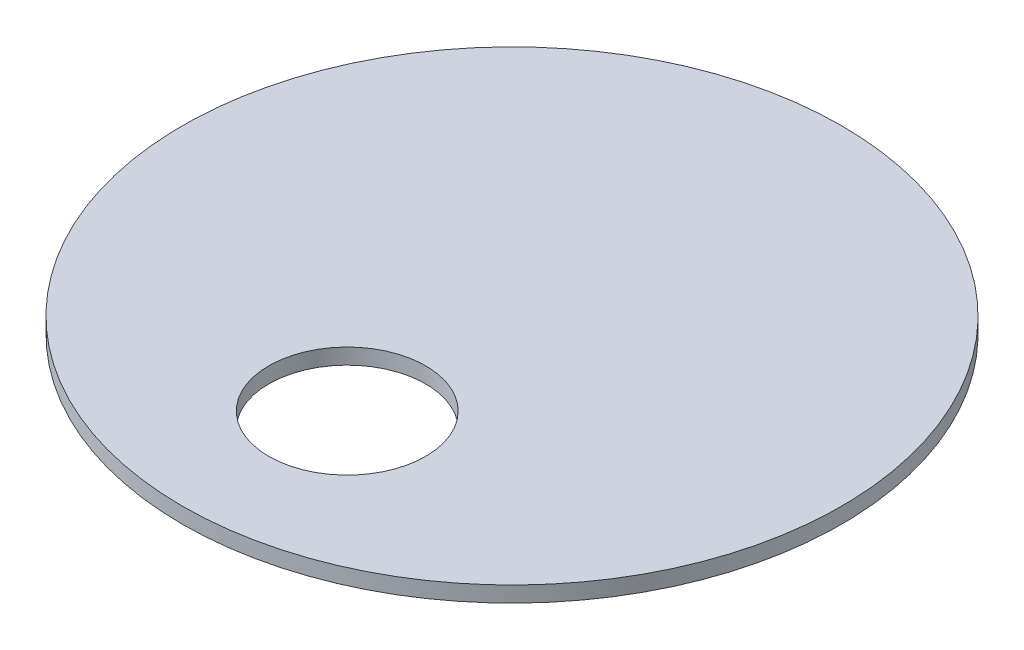
ISO-10303-21;
HEADER;
FILE_DESCRIPTION(('STEP AP214'),'2;1');
FILE_NAME('part.step','',(''),(''),'','','');
FILE_SCHEMA(('AUTOMOTIVE_DESIGN { 1 0 10303 214 1 1 1 1 }'));
ENDSEC;
DATA;
#1=APPLICATION_CONTEXT('core data for automotive mechanical design processes');
#2=APPLICATION_PROTOCOL_DEFINITION('international standard','automotive_design',2000,#1);
#3=PRODUCT_CONTEXT('',#1,'mechanical');
#4=PRODUCT('Part','Part','',(#3));
#5=PRODUCT_RELATED_PRODUCT_CATEGORY('part','',(#4));
#6=PRODUCT_DEFINITION_FORMATION('','',#4);
#7=PRODUCT_DEFINITION_CONTEXT('part definition',#1,'design');
#8=PRODUCT_DEFINITION('design','',#6,#7);
#9=PRODUCT_DEFINITION_SHAPE('','',#8);
#10=(LENGTH_UNIT() NAMED_UNIT(*) SI_UNIT(.MILLI.,.METRE.));
#11=(NAMED_UNIT(*) PLANE_ANGLE_UNIT() SI_UNIT($,.RADIAN.));
#12=(NAMED_UNIT(*) SI_UNIT($,.STERADIAN.) SOLID_ANGLE_UNIT());
#13=UNCERTAINTY_MEASURE_WITH_UNIT(LENGTH_MEASURE(1.E-05),#10,'distance_accuracy_value','');
#14=(GEOMETRIC_REPRESENTATION_CONTEXT(3) GLOBAL_UNCERTAINTY_ASSIGNED_CONTEXT((#13)) GLOBAL_UNIT_ASSIGNED_CONTEXT((#10,
#11,#12)) REPRESENTATION_CONTEXT('',''));
#15=CARTESIAN_POINT('',(0.,0.,0.));
#16=DIRECTION('',(0.,0.,1.));
#17=DIRECTION('',(1.,0.,0.));
#18=AXIS2_PLACEMENT_3D('',#15,#16,#17);
#19=CARTESIAN_POINT('',(0.,5.,0.));
#20=DIRECTION('',(0.,1.,0.));
#21=DIRECTION('',(0.,0.,1.));
#22=AXIS2_PLACEMENT_3D('',#19,#20,#21);
#23=PLANE('',#22);
#24=CARTESIAN_POINT('',(0.,5.,0.));
#25=DIRECTION('',(0.,1.,0.));
#26=DIRECTION('',(0.,0.,1.));
#27=AXIS2_PLACEMENT_3D('',#24,#25,#26);
#28=CIRCLE('',#27,105.);
#29=CARTESIAN_POINT('',(0.,5.,105.));
#30=VERTEX_POINT('',#29);
#31=EDGE_CURVE('E10',#30,#30,#28,.T.);
#32=ORIENTED_EDGE('',*,*,#31,.T.);
#33=EDGE_LOOP('',(#32));
#34=FACE_BOUND('',#33,.T.);
#35=CARTESIAN_POINT('',(0.,5.,52.5));
#36=DIRECTION('',(0.,1.,0.));
#37=DIRECTION('',(0.,0.,1.));
#38=AXIS2_PLACEMENT_3D('',#35,#36,#37);
#39=CIRCLE('',#38,25.);
#40=CARTESIAN_POINT('',(0.,5.,77.5));
#41=VERTEX_POINT('',#40);
#42=EDGE_CURVE('E42',#41,#41,#39,.T.);
#43=ORIENTED_EDGE('',*,*,#42,.F.);
#44=EDGE_LOOP('',(#43));
#45=FACE_BOUND('',#44,.T.);
#46=ADVANCED_FACE('F31',(#34,#45),#23,.T.);
#47=CARTESIAN_POINT('',(0.,0.,0.));
#48=DIRECTION('',(0.,1.,0.));
#49=DIRECTION('',(0.,0.,1.));
#50=AXIS2_PLACEMENT_3D('',#47,#48,#49);
#51=PLANE('',#50);
#52=CARTESIAN_POINT('',(0.,0.,0.));
#53=DIRECTION('',(0.,1.,0.));
#54=DIRECTION('',(0.,0.,1.));
#55=AXIS2_PLACEMENT_3D('',#52,#53,#54);
#56=CIRCLE('',#55,105.);
#57=CARTESIAN_POINT('',(0.,0.,105.));
#58=VERTEX_POINT('',#57);
#59=EDGE_CURVE('E35',#58,#58,#56,.T.);
#60=ORIENTED_EDGE('',*,*,#59,.F.);
#61=EDGE_LOOP('',(#60));
#62=FACE_BOUND('',#61,.T.);
#63=CARTESIAN_POINT('',(0.,0.,52.5));
#64=DIRECTION('',(0.,1.,0.));
#65=DIRECTION('',(0.,0.,1.));
#66=AXIS2_PLACEMENT_3D('',#63,#64,#65);
#67=CIRCLE('',#66,25.);
#68=CARTESIAN_POINT('',(0.,0.,77.5));
#69=VERTEX_POINT('',#68);
#70=EDGE_CURVE('E44',#69,#69,#67,.T.);
#71=ORIENTED_EDGE('',*,*,#70,.T.);
#72=EDGE_LOOP('',(#71));
#73=FACE_BOUND('',#72,.T.);
#74=ADVANCED_FACE('F54',(#62,#73),#51,.F.);
#75=CARTESIAN_POINT('',(0.,5.,0.));
#76=DIRECTION('',(0.,-1.,0.));
#77=DIRECTION('',(0.,0.,-1.));
#78=AXIS2_PLACEMENT_3D('',#75,#76,#77);
#79=CYLINDRICAL_SURFACE('',#78,105.);
#80=ORIENTED_EDGE('',*,*,#31,.F.);
#81=EDGE_LOOP('',(#80));
#82=FACE_BOUND('',#81,.T.);
#83=ORIENTED_EDGE('',*,*,#59,.T.);
#84=EDGE_LOOP('',(#83));
#85=FACE_BOUND('',#84,.T.);
#86=ADVANCED_FACE('F33',(#82,#85),#79,.T.);
#87=CARTESIAN_POINT('',(0.,5.,52.5));
#88=DIRECTION('',(0.,-1.,0.));
#89=DIRECTION('',(0.,0.,-1.));
#90=AXIS2_PLACEMENT_3D('',#87,#88,#89);
#91=CYLINDRICAL_SURFACE('',#90,25.);
#92=ORIENTED_EDGE('',*,*,#42,.T.);
#93=EDGE_LOOP('',(#92));
#94=FACE_BOUND('',#93,.T.);
#95=ORIENTED_EDGE('',*,*,#70,.F.);
#96=EDGE_LOOP('',(#95));
#97=FACE_BOUND('',#96,.T.);
#98=ADVANCED_FACE('F50',(#94,#97),#91,.F.);
#99=CLOSED_SHELL('',(#46,#74,#86,#98));
#100=MANIFOLD_SOLID_BREP('B2',#99);
#101=ADVANCED_BREP_SHAPE_REPRESENTATION('',(#18,#100),#14);
#102=SHAPE_DEFINITION_REPRESENTATION(#9,#101);
ENDSEC;
END-ISO-10303-21;
